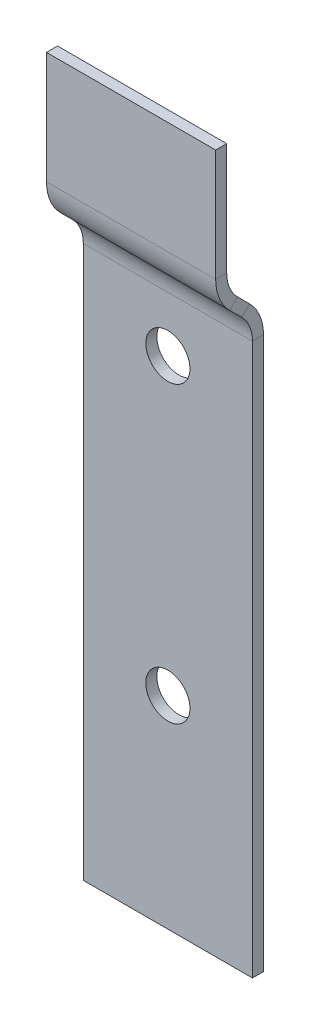
ISO-10303-21;
HEADER;
FILE_DESCRIPTION(('STEP AP214'),'2;1');
FILE_NAME('part.step','',(''),(''),'','','');
FILE_SCHEMA(('AUTOMOTIVE_DESIGN { 1 0 10303 214 1 1 1 1 }'));
ENDSEC;
DATA;
#1=APPLICATION_CONTEXT('core data for automotive mechanical design processes');
#2=APPLICATION_PROTOCOL_DEFINITION('international standard','automotive_design',2000,#1);
#3=PRODUCT_CONTEXT('',#1,'mechanical');
#4=PRODUCT('Part','Part','',(#3));
#5=PRODUCT_RELATED_PRODUCT_CATEGORY('part','',(#4));
#6=PRODUCT_DEFINITION_FORMATION('','',#4);
#7=PRODUCT_DEFINITION_CONTEXT('part definition',#1,'design');
#8=PRODUCT_DEFINITION('design','',#6,#7);
#9=PRODUCT_DEFINITION_SHAPE('','',#8);
#10=(LENGTH_UNIT() NAMED_UNIT(*) SI_UNIT(.MILLI.,.METRE.));
#11=(NAMED_UNIT(*) PLANE_ANGLE_UNIT() SI_UNIT($,.RADIAN.));
#12=(NAMED_UNIT(*) SI_UNIT($,.STERADIAN.) SOLID_ANGLE_UNIT());
#13=UNCERTAINTY_MEASURE_WITH_UNIT(LENGTH_MEASURE(1.E-05),#10,'distance_accuracy_value','');
#14=(GEOMETRIC_REPRESENTATION_CONTEXT(3) GLOBAL_UNCERTAINTY_ASSIGNED_CONTEXT((#13)) GLOBAL_UNIT_ASSIGNED_CONTEXT((#10,
#11,#12)) REPRESENTATION_CONTEXT('',''));
#15=CARTESIAN_POINT('',(0.,0.,0.));
#16=DIRECTION('',(0.,0.,1.));
#17=DIRECTION('',(1.,0.,0.));
#18=AXIS2_PLACEMENT_3D('',#15,#16,#17);
#19=CARTESIAN_POINT('',(-11.5000000000006,50.0000000000007,-50.1779765508196));
#20=DIRECTION('',(0.,1.,0.));
#21=DIRECTION('',(-1.,0.,0.));
#22=AXIS2_PLACEMENT_3D('',#19,#20,#21);
#23=PLANE('',#22);
#24=DIRECTION('',(-1.,0.,0.));
#25=VECTOR('',#24,1.);
#26=CARTESIAN_POINT('',(-11.5000000000001,50.0000000000007,4.99999999999998));
#27=LINE('',#26,#25);
#28=CARTESIAN_POINT('',(11.4999999999999,50.0000000000005,4.99999999999973));
#29=VERTEX_POINT('',#28);
#30=CARTESIAN_POINT('',(-11.5,50.0000000000007,5.00000000000018));
#31=VERTEX_POINT('',#30);
#32=EDGE_CURVE('E186',#29,#31,#27,.T.);
#33=ORIENTED_EDGE('',*,*,#32,.F.);
#34=DIRECTION('',(0.,0.,1.));
#35=VECTOR('',#34,1.);
#36=CARTESIAN_POINT('',(11.4999999999994,50.0000000000007,-50.1779765508199));
#37=LINE('',#36,#35);
#38=CARTESIAN_POINT('',(11.5,50.0000000000007,3.49999999999983));
#39=VERTEX_POINT('',#38);
#40=EDGE_CURVE('E11',#39,#29,#37,.T.);
#41=ORIENTED_EDGE('',*,*,#40,.F.);
#42=DIRECTION('',(-1.,0.,0.));
#43=VECTOR('',#42,1.);
#44=CARTESIAN_POINT('',(-11.5,50.0000000000007,3.49999999999997));
#45=LINE('',#44,#43);
#46=CARTESIAN_POINT('',(-11.5,50.0000000000007,3.49999999999997));
#47=VERTEX_POINT('',#46);
#48=EDGE_CURVE('E60',#39,#47,#45,.T.);
#49=ORIENTED_EDGE('',*,*,#48,.T.);
#50=DIRECTION('',(0.,0.,1.));
#51=VECTOR('',#50,1.);
#52=CARTESIAN_POINT('',(-11.5000000000006,50.0000000000007,-50.1779765508196));
#53=LINE('',#52,#51);
#54=EDGE_CURVE('E200',#47,#31,#53,.T.);
#55=ORIENTED_EDGE('',*,*,#54,.T.);
#56=EDGE_LOOP('',(#33,#41,#49,#55));
#57=FACE_BOUND('',#56,.T.);
#58=ADVANCED_FACE('F41',(#57),#23,.T.);
#59=CARTESIAN_POINT('',(-11.5000000000005,-51.5762347563546,-50.1779765508194));
#60=DIRECTION('',(-1.,0.,0.));
#61=DIRECTION('',(0.,-1.,0.));
#62=AXIS2_PLACEMENT_3D('',#59,#60,#61);
#63=PLANE('',#62);
#64=DIRECTION('',(0.,-1.,0.));
#65=VECTOR('',#64,1.);
#66=CARTESIAN_POINT('',(-11.4999999999997,-51.5762347563544,4.99999999999996));
#67=LINE('',#66,#65);
#68=CARTESIAN_POINT('',(-11.4999999999999,34.7634559672912,5.00000000000008));
#69=VERTEX_POINT('',#68);
#70=EDGE_CURVE('E81',#31,#69,#67,.T.);
#71=ORIENTED_EDGE('',*,*,#70,.F.);
#72=ORIENTED_EDGE('',*,*,#54,.F.);
#73=DIRECTION('',(0.,-1.,0.));
#74=VECTOR('',#73,1.);
#75=CARTESIAN_POINT('',(-11.4999999999999,-51.5762347563546,3.50000000000023));
#76=LINE('',#75,#74);
#77=CARTESIAN_POINT('',(-11.5,34.7634559672912,3.49999999999999));
#78=VERTEX_POINT('',#77);
#79=EDGE_CURVE('E197',#47,#78,#76,.T.);
#80=ORIENTED_EDGE('',*,*,#79,.T.);
#81=DIRECTION('',(0.,0.,1.));
#82=VECTOR('',#81,1.);
#83=CARTESIAN_POINT('',(-11.5000000000006,34.7634559672914,-50.1779765508196));
#84=LINE('',#83,#82);
#85=EDGE_CURVE('E195',#78,#69,#84,.T.);
#86=ORIENTED_EDGE('',*,*,#85,.T.);
#87=EDGE_LOOP('',(#71,#72,#80,#86));
#88=FACE_BOUND('',#87,.T.);
#89=ADVANCED_FACE('F214',(#88),#63,.T.);
#90=CARTESIAN_POINT('',(0.,-1.5762347563548,5.00000000000005));
#91=DIRECTION('',(0.,0.,-1.));
#92=DIRECTION('',(-1.,0.,0.));
#93=AXIS2_PLACEMENT_3D('',#90,#91,#92);
#94=PLANE('',#93);
#95=ORIENTED_EDGE('',*,*,#70,.T.);
#96=DIRECTION('',(1.,0.,0.));
#97=VECTOR('',#96,1.);
#98=CARTESIAN_POINT('',(0.,34.7634559672912,4.9999999999998));
#99=LINE('',#98,#97);
#100=CARTESIAN_POINT('',(11.5,34.7634559672911,4.99999999999985));
#101=VERTEX_POINT('',#100);
#102=EDGE_CURVE('E192',#69,#101,#99,.T.);
#103=ORIENTED_EDGE('',*,*,#102,.T.);
#104=DIRECTION('',(0.,1.,0.));
#105=VECTOR('',#104,1.);
#106=CARTESIAN_POINT('',(11.5000000000002,-51.5762347563548,4.99999999999983));
#107=LINE('',#106,#105);
#108=EDGE_CURVE('E189',#101,#29,#107,.T.);
#109=ORIENTED_EDGE('',*,*,#108,.T.);
#110=ORIENTED_EDGE('',*,*,#32,.T.);
#111=EDGE_LOOP('',(#95,#103,#109,#110));
#112=FACE_BOUND('',#111,.T.);
#113=ADVANCED_FACE('F213',(#112),#94,.F.);
#114=CARTESIAN_POINT('',(11.4999999999997,-51.5762347563547,-50.1779765508197));
#115=DIRECTION('',(1.,0.,0.));
#116=DIRECTION('',(0.,1.,0.));
#117=AXIS2_PLACEMENT_3D('',#114,#115,#116);
#118=PLANE('',#117);
#119=ORIENTED_EDGE('',*,*,#108,.F.);
#120=DIRECTION('',(0.,0.,1.));
#121=VECTOR('',#120,1.);
#122=CARTESIAN_POINT('',(11.4999999999993,34.7634559672911,-50.1779765508198));
#123=LINE('',#122,#121);
#124=CARTESIAN_POINT('',(11.5,34.7634559672911,3.49999999999975));
#125=VERTEX_POINT('',#124);
#126=EDGE_CURVE('E160',#125,#101,#123,.T.);
#127=ORIENTED_EDGE('',*,*,#126,.F.);
#128=DIRECTION('',(0.,1.,0.));
#129=VECTOR('',#128,1.);
#130=CARTESIAN_POINT('',(11.5000000000003,-51.5762347563547,3.49999999999988));
#131=LINE('',#130,#129);
#132=EDGE_CURVE('E51',#125,#39,#131,.T.);
#133=ORIENTED_EDGE('',*,*,#132,.T.);
#134=ORIENTED_EDGE('',*,*,#40,.T.);
#135=EDGE_LOOP('',(#119,#127,#133,#134));
#136=FACE_BOUND('',#135,.T.);
#137=ADVANCED_FACE('F210',(#136),#118,.T.);
#138=CARTESIAN_POINT('',(0.,-1.57623475635469,3.49999999999996));
#139=DIRECTION('',(0.,0.,-1.));
#140=DIRECTION('',(-1.,0.,0.));
#141=AXIS2_PLACEMENT_3D('',#138,#139,#140);
#142=PLANE('',#141);
#143=DIRECTION('',(1.,0.,0.));
#144=VECTOR('',#143,1.);
#145=CARTESIAN_POINT('',(-1.02340721926679E-13,34.7634559672912,3.49999999999982));
#146=LINE('',#145,#144);
#147=EDGE_CURVE('E45',#78,#125,#146,.T.);
#148=ORIENTED_EDGE('',*,*,#147,.F.);
#149=ORIENTED_EDGE('',*,*,#79,.F.);
#150=ORIENTED_EDGE('',*,*,#48,.F.);
#151=ORIENTED_EDGE('',*,*,#132,.F.);
#152=EDGE_LOOP('',(#148,#149,#150,#151));
#153=FACE_BOUND('',#152,.T.);
#154=ADVANCED_FACE('F43',(#153),#142,.T.);
#155=CARTESIAN_POINT('',(-11.5000000000001,-60.3810116129127,-22.0716497886724));
#156=DIRECTION('',(1.,0.,0.));
#157=DIRECTION('',(0.,0.707106781186548,-0.707106781186547));
#158=AXIS2_PLACEMENT_3D('',#155,#156,#157);
#159=PLANE('',#158);
#160=DIRECTION('',(0.,-0.707106781186547,-0.707106781186549));
#161=VECTOR('',#160,1.);
#162=CARTESIAN_POINT('',(-11.5000000000001,-26.6301366230799,-55.8225247785052));
#163=LINE('',#162,#161);
#164=CARTESIAN_POINT('',(-11.5000000000001,31.227922061358,2.03553390593287));
#165=VERTEX_POINT('',#164);
#166=CARTESIAN_POINT('',(-11.5000000000001,29.5961940777128,0.403805922287274));
#167=VERTEX_POINT('',#166);
#168=EDGE_CURVE('E234',#165,#167,#163,.T.);
#169=ORIENTED_EDGE('',*,*,#168,.T.);
#170=DIRECTION('',(0.,0.707106781186548,-0.707106781186547));
#171=VECTOR('',#170,1.);
#172=CARTESIAN_POINT('',(-11.5000000000001,-4.15468091212007,34.1546809121201));
#173=LINE('',#172,#171);
#174=CARTESIAN_POINT('',(-11.5000000000001,28.5355339059329,1.46446609406716));
#175=VERTEX_POINT('',#174);
#176=EDGE_CURVE('E179',#175,#167,#173,.T.);
#177=ORIENTED_EDGE('',*,*,#176,.F.);
#178=DIRECTION('',(0.,-0.707106781186547,-0.707106781186549));
#179=VECTOR('',#178,1.);
#180=CARTESIAN_POINT('',(-11.5000000000001,-27.6907967948597,-54.7618646067254));
#181=LINE('',#180,#179);
#182=CARTESIAN_POINT('',(-11.5000000000001,30.1672618895784,3.09619407771242));
#183=VERTEX_POINT('',#182);
#184=EDGE_CURVE('E151',#183,#175,#181,.T.);
#185=ORIENTED_EDGE('',*,*,#184,.F.);
#186=DIRECTION('',(0.,0.707106781186548,-0.707106781186547));
#187=VECTOR('',#186,1.);
#188=CARTESIAN_POINT('',(-11.5000000000001,-2.52295292847457,35.7864088957653));
#189=LINE('',#188,#187);
#190=EDGE_CURVE('E182',#183,#165,#189,.T.);
#191=ORIENTED_EDGE('',*,*,#190,.T.);
#192=EDGE_LOOP('',(#169,#177,#185,#191));
#193=FACE_BOUND('',#192,.T.);
#194=ADVANCED_FACE('F283',(#193),#159,.F.);
#195=CARTESIAN_POINT('',(11.5,-60.3810116129124,-22.0716497886727));
#196=DIRECTION('',(-1.,0.,0.));
#197=DIRECTION('',(0.,-0.707106781186548,0.707106781186547));
#198=AXIS2_PLACEMENT_3D('',#195,#196,#197);
#199=PLANE('',#198);
#200=DIRECTION('',(0.,0.707106781186547,0.707106781186549));
#201=VECTOR('',#200,1.);
#202=CARTESIAN_POINT('',(11.5,-26.6301366230796,-55.8225247785055));
#203=LINE('',#202,#201);
#204=CARTESIAN_POINT('',(11.4999999999998,29.596194077713,0.403805922287229));
#205=VERTEX_POINT('',#204);
#206=CARTESIAN_POINT('',(11.4999999999999,31.2279220613584,2.03553390593253));
#207=VERTEX_POINT('',#206);
#208=EDGE_CURVE('E169',#205,#207,#203,.T.);
#209=ORIENTED_EDGE('',*,*,#208,.T.);
#210=DIRECTION('',(0.,0.707106781186548,-0.707106781186547));
#211=VECTOR('',#210,1.);
#212=CARTESIAN_POINT('',(11.4999999999998,-2.52295292847445,35.7864088957653));
#213=LINE('',#212,#211);
#214=CARTESIAN_POINT('',(11.4999999999999,30.1672618895785,3.09619407771243));
#215=VERTEX_POINT('',#214);
#216=EDGE_CURVE('E157',#215,#207,#213,.T.);
#217=ORIENTED_EDGE('',*,*,#216,.F.);
#218=DIRECTION('',(0.,0.707106781186547,0.707106781186549));
#219=VECTOR('',#218,1.);
#220=CARTESIAN_POINT('',(11.5,-27.6907967948594,-54.7618646067256));
#221=LINE('',#220,#219);
#222=CARTESIAN_POINT('',(11.4999999999999,28.5355339059329,1.4644660940673));
#223=VERTEX_POINT('',#222);
#224=EDGE_CURVE('E167',#223,#215,#221,.T.);
#225=ORIENTED_EDGE('',*,*,#224,.F.);
#226=DIRECTION('',(0.,0.707106781186548,-0.707106781186547));
#227=VECTOR('',#226,1.);
#228=CARTESIAN_POINT('',(11.4999999999999,-4.15468091211991,34.15468091212));
#229=LINE('',#228,#227);
#230=EDGE_CURVE('E171',#223,#205,#229,.T.);
#231=ORIENTED_EDGE('',*,*,#230,.T.);
#232=EDGE_LOOP('',(#209,#217,#225,#231));
#233=FACE_BOUND('',#232,.T.);
#234=ADVANCED_FACE('F165',(#233),#199,.F.);
#235=CARTESIAN_POINT('',(0.,7.6645422644677,-19.406525547398));
#236=DIRECTION('',(0.,0.707106781186549,-0.707106781186547));
#237=DIRECTION('',(-1.,0.,0.));
#238=AXIS2_PLACEMENT_3D('',#235,#236,#237);
#239=PLANE('',#238);
#240=DIRECTION('',(1.,0.,0.));
#241=VECTOR('',#240,1.);
#242=CARTESIAN_POINT('',(-1.34958498477987E-13,30.1672618895784,3.09619407771242));
#243=LINE('',#242,#241);
#244=EDGE_CURVE('E147',#183,#215,#243,.T.);
#245=ORIENTED_EDGE('',*,*,#244,.F.);
#246=ORIENTED_EDGE('',*,*,#184,.T.);
#247=DIRECTION('',(1.,0.,0.));
#248=VECTOR('',#247,1.);
#249=CARTESIAN_POINT('',(-1.50122922943837E-13,28.5355339059328,1.46446609406721));
#250=LINE('',#249,#248);
#251=EDGE_CURVE('E97',#175,#223,#250,.T.);
#252=ORIENTED_EDGE('',*,*,#251,.T.);
#253=ORIENTED_EDGE('',*,*,#224,.T.);
#254=EDGE_LOOP('',(#245,#246,#252,#253));
#255=FACE_BOUND('',#254,.T.);
#256=ADVANCED_FACE('F173',(#255),#239,.F.);
#257=CARTESIAN_POINT('',(0.,8.7252024362475,-20.4671857191777));
#258=DIRECTION('',(0.,0.707106781186549,-0.707106781186547));
#259=DIRECTION('',(-1.,0.,0.));
#260=AXIS2_PLACEMENT_3D('',#257,#258,#259);
#261=PLANE('',#260);
#262=ORIENTED_EDGE('',*,*,#168,.F.);
#263=DIRECTION('',(1.,0.,0.));
#264=VECTOR('',#263,1.);
#265=CARTESIAN_POINT('',(-1.50504209552341E-13,31.2279220613582,2.03553390593255));
#266=LINE('',#265,#264);
#267=EDGE_CURVE('E277',#165,#207,#266,.T.);
#268=ORIENTED_EDGE('',*,*,#267,.T.);
#269=ORIENTED_EDGE('',*,*,#208,.F.);
#270=DIRECTION('',(1.,0.,0.));
#271=VECTOR('',#270,1.);
#272=CARTESIAN_POINT('',(0.,29.5961940777126,0.403805922287306));
#273=LINE('',#272,#271);
#274=EDGE_CURVE('E152',#167,#205,#273,.T.);
#275=ORIENTED_EDGE('',*,*,#274,.F.);
#276=EDGE_LOOP('',(#262,#268,#269,#275));
#277=FACE_BOUND('',#276,.T.);
#278=ADVANCED_FACE('F318',(#277),#261,.T.);
#279=CARTESIAN_POINT('',(-11.4999999999999,-49.9999999999997,156.894869259642));
#280=DIRECTION('',(0.,1.,0.));
#281=DIRECTION('',(-1.,0.,0.));
#282=AXIS2_PLACEMENT_3D('',#279,#280,#281);
#283=PLANE('',#282);
#284=DIRECTION('',(1.,0.,0.));
#285=VECTOR('',#284,1.);
#286=CARTESIAN_POINT('',(-11.4999999999999,-50.,-1.49999999999987));
#287=LINE('',#286,#285);
#288=CARTESIAN_POINT('',(-11.4999999999999,-49.9999999999997,-1.50000000000008));
#289=VERTEX_POINT('',#288);
#290=CARTESIAN_POINT('',(11.5,-50.,-1.5));
#291=VERTEX_POINT('',#290);
#292=EDGE_CURVE('E268',#289,#291,#287,.T.);
#293=ORIENTED_EDGE('',*,*,#292,.T.);
#294=DIRECTION('',(0.,0.,-1.));
#295=VECTOR('',#294,1.);
#296=CARTESIAN_POINT('',(11.5,-49.9999999999999,156.894869259642));
#297=LINE('',#296,#295);
#298=CARTESIAN_POINT('',(11.5,-49.9999999999999,0.));
#299=VERTEX_POINT('',#298);
#300=EDGE_CURVE('E232',#299,#291,#297,.T.);
#301=ORIENTED_EDGE('',*,*,#300,.F.);
#302=DIRECTION('',(1.,0.,0.));
#303=VECTOR('',#302,1.);
#304=CARTESIAN_POINT('',(-11.4999999999999,-49.9999999999997,-1.14925430283463E-13));
#305=LINE('',#304,#303);
#306=CARTESIAN_POINT('',(-11.4999999999999,-49.9999999999997,-1.14925430283463E-13));
#307=VERTEX_POINT('',#306);
#308=EDGE_CURVE('E255',#307,#299,#305,.T.);
#309=ORIENTED_EDGE('',*,*,#308,.F.);
#310=DIRECTION('',(0.,0.,-1.));
#311=VECTOR('',#310,1.);
#312=CARTESIAN_POINT('',(-11.4999999999999,-49.9999999999997,156.894869259642));
#313=LINE('',#312,#311);
#314=EDGE_CURVE('E265',#307,#289,#313,.T.);
#315=ORIENTED_EDGE('',*,*,#314,.T.);
#316=EDGE_LOOP('',(#293,#301,#309,#315));
#317=FACE_BOUND('',#316,.T.);
#318=ADVANCED_FACE('F304',(#317),#283,.F.);
#319=CARTESIAN_POINT('',(-1.33573707650214E-13,-22.5000000000001,-1.50100000000003));
#320=DIRECTION('',(0.,0.,1.));
#321=DIRECTION('',(1.,0.,0.));
#322=AXIS2_PLACEMENT_3D('',#319,#320,#321);
#323=CYLINDRICAL_SURFACE('',#322,3.);
#324=CARTESIAN_POINT('',(-1.33573707650214E-13,-22.4999999999999,-1.5000000000001));
#325=DIRECTION('',(0.,0.,-1.));
#326=DIRECTION('',(-1.,0.,0.));
#327=AXIS2_PLACEMENT_3D('',#324,#325,#326);
#328=CIRCLE('',#327,3.);
#329=CARTESIAN_POINT('',(-3.00000000000013,-22.4999999999999,-1.5000000000001));
#330=VERTEX_POINT('',#329);
#331=EDGE_CURVE('E241',#330,#330,#328,.F.);
#332=ORIENTED_EDGE('',*,*,#331,.F.);
#333=EDGE_LOOP('',(#332));
#334=FACE_BOUND('',#333,.T.);
#335=CARTESIAN_POINT('',(-1.2490009027033E-13,-22.5,0.));
#336=DIRECTION('',(0.,0.,1.));
#337=DIRECTION('',(1.,0.,0.));
#338=AXIS2_PLACEMENT_3D('',#335,#336,#337);
#339=CIRCLE('',#338,3.);
#340=CARTESIAN_POINT('',(2.99999999999988,-22.5,0.));
#341=VERTEX_POINT('',#340);
#342=EDGE_CURVE('E262',#341,#341,#339,.T.);
#343=ORIENTED_EDGE('',*,*,#342,.T.);
#344=EDGE_LOOP('',(#343));
#345=FACE_BOUND('',#344,.T.);
#346=ADVANCED_FACE('F326',(#334,#345),#323,.F.);
#347=CARTESIAN_POINT('',(0.,17.5000000000002,-1.50100000000018));
#348=DIRECTION('',(0.,0.,1.));
#349=DIRECTION('',(1.,0.,0.));
#350=AXIS2_PLACEMENT_3D('',#347,#348,#349);
#351=CYLINDRICAL_SURFACE('',#350,3.);
#352=CARTESIAN_POINT('',(0.,17.5000000000001,-1.50000000000006));
#353=DIRECTION('',(0.,0.,-1.));
#354=DIRECTION('',(-1.,0.,0.));
#355=AXIS2_PLACEMENT_3D('',#352,#353,#354);
#356=CIRCLE('',#355,3.);
#357=CARTESIAN_POINT('',(-2.99999999999995,17.5000000000001,-1.50000000000006));
#358=VERTEX_POINT('',#357);
#359=EDGE_CURVE('E244',#358,#358,#356,.F.);
#360=ORIENTED_EDGE('',*,*,#359,.F.);
#361=EDGE_LOOP('',(#360));
#362=FACE_BOUND('',#361,.T.);
#363=CARTESIAN_POINT('',(-1.45716771982052E-13,17.5000000000001,0.));
#364=DIRECTION('',(0.,0.,1.));
#365=DIRECTION('',(1.,0.,0.));
#366=AXIS2_PLACEMENT_3D('',#363,#364,#365);
#367=CIRCLE('',#366,3.);
#368=CARTESIAN_POINT('',(2.99999999999985,17.5000000000001,0.));
#369=VERTEX_POINT('',#368);
#370=EDGE_CURVE('E259',#369,#369,#367,.T.);
#371=ORIENTED_EDGE('',*,*,#370,.T.);
#372=EDGE_LOOP('',(#371));
#373=FACE_BOUND('',#372,.T.);
#374=ADVANCED_FACE('F489',(#362,#373),#351,.F.);
#375=CARTESIAN_POINT('',(0.,0.,0.));
#376=DIRECTION('',(0.,0.,-1.));
#377=DIRECTION('',(-1.,0.,0.));
#378=AXIS2_PLACEMENT_3D('',#375,#376,#377);
#379=PLANE('',#378);
#380=ORIENTED_EDGE('',*,*,#370,.F.);
#381=EDGE_LOOP('',(#380));
#382=FACE_BOUND('',#381,.T.);
#383=ORIENTED_EDGE('',*,*,#342,.F.);
#384=EDGE_LOOP('',(#383));
#385=FACE_BOUND('',#384,.T.);
#386=DIRECTION('',(1.,0.,0.));
#387=VECTOR('',#386,1.);
#388=CARTESIAN_POINT('',(0.,25.,0.));
#389=LINE('',#388,#387);
#390=CARTESIAN_POINT('',(-11.5,25.0000000000002,-1.04950770296597E-13));
#391=VERTEX_POINT('',#390);
#392=CARTESIAN_POINT('',(11.4999999999999,25.0000000000004,-1.50920942409982E-13));
#393=VERTEX_POINT('',#392);
#394=EDGE_CURVE('E228',#391,#393,#389,.T.);
#395=ORIENTED_EDGE('',*,*,#394,.F.);
#396=DIRECTION('',(0.,-1.,0.));
#397=VECTOR('',#396,1.);
#398=CARTESIAN_POINT('',(-11.4999999999999,-49.9999999999997,-1.14925430283463E-13));
#399=LINE('',#398,#397);
#400=EDGE_CURVE('E257',#391,#307,#399,.T.);
#401=ORIENTED_EDGE('',*,*,#400,.T.);
#402=ORIENTED_EDGE('',*,*,#308,.T.);
#403=DIRECTION('',(0.,1.,0.));
#404=VECTOR('',#403,1.);
#405=CARTESIAN_POINT('',(11.5,-49.9999999999999,-1.83663848019044E-13));
#406=LINE('',#405,#404);
#407=EDGE_CURVE('E252',#299,#393,#406,.T.);
#408=ORIENTED_EDGE('',*,*,#407,.T.);
#409=EDGE_LOOP('',(#395,#401,#402,#408));
#410=FACE_BOUND('',#409,.T.);
#411=ADVANCED_FACE('F308',(#382,#385,#410),#379,.F.);
#412=CARTESIAN_POINT('',(-11.4999999999999,-49.9999999999997,156.894869259642));
#413=DIRECTION('',(1.,0.,0.));
#414=DIRECTION('',(0.,1.,0.));
#415=AXIS2_PLACEMENT_3D('',#412,#413,#414);
#416=PLANE('',#415);
#417=DIRECTION('',(0.,-1.,0.));
#418=VECTOR('',#417,1.);
#419=CARTESIAN_POINT('',(-11.4999999999999,-50.,-1.49999999999987));
#420=LINE('',#419,#418);
#421=CARTESIAN_POINT('',(-11.4999999999999,25.0000000000002,-1.50000000000008));
#422=VERTEX_POINT('',#421);
#423=EDGE_CURVE('E250',#422,#289,#420,.T.);
#424=ORIENTED_EDGE('',*,*,#423,.T.);
#425=ORIENTED_EDGE('',*,*,#314,.F.);
#426=ORIENTED_EDGE('',*,*,#400,.F.);
#427=DIRECTION('',(0.,0.,-1.));
#428=VECTOR('',#427,1.);
#429=CARTESIAN_POINT('',(-11.4999999999999,25.0000000000002,156.894869259642));
#430=LINE('',#429,#428);
#431=EDGE_CURVE('E247',#391,#422,#430,.T.);
#432=ORIENTED_EDGE('',*,*,#431,.T.);
#433=EDGE_LOOP('',(#424,#425,#426,#432));
#434=FACE_BOUND('',#433,.T.);
#435=ADVANCED_FACE('F296',(#434),#416,.F.);
#436=CARTESIAN_POINT('',(-1.38777878078145E-13,1.66533453693773E-13,-1.50000000000009));
#437=DIRECTION('',(0.,0.,-1.));
#438=DIRECTION('',(-1.,0.,0.));
#439=AXIS2_PLACEMENT_3D('',#436,#437,#438);
#440=PLANE('',#439);
#441=ORIENTED_EDGE('',*,*,#359,.T.);
#442=EDGE_LOOP('',(#441));
#443=FACE_BOUND('',#442,.T.);
#444=ORIENTED_EDGE('',*,*,#331,.T.);
#445=EDGE_LOOP('',(#444));
#446=FACE_BOUND('',#445,.T.);
#447=ORIENTED_EDGE('',*,*,#423,.F.);
#448=DIRECTION('',(1.,0.,0.));
#449=VECTOR('',#448,1.);
#450=CARTESIAN_POINT('',(0.,25.0000000000001,-1.50000000000012));
#451=LINE('',#450,#449);
#452=CARTESIAN_POINT('',(11.4999999999999,25.0000000000004,-1.50000000000024));
#453=VERTEX_POINT('',#452);
#454=EDGE_CURVE('E238',#422,#453,#451,.T.);
#455=ORIENTED_EDGE('',*,*,#454,.T.);
#456=DIRECTION('',(0.,1.,0.));
#457=VECTOR('',#456,1.);
#458=CARTESIAN_POINT('',(11.5,-50.,-1.5));
#459=LINE('',#458,#457);
#460=EDGE_CURVE('E235',#291,#453,#459,.T.);
#461=ORIENTED_EDGE('',*,*,#460,.F.);
#462=ORIENTED_EDGE('',*,*,#292,.F.);
#463=EDGE_LOOP('',(#447,#455,#461,#462));
#464=FACE_BOUND('',#463,.T.);
#465=ADVANCED_FACE('F300',(#443,#446,#464),#440,.T.);
#466=CARTESIAN_POINT('',(11.5,-49.9999999999999,156.894869259642));
#467=DIRECTION('',(-1.,0.,0.));
#468=DIRECTION('',(0.,-1.,0.));
#469=AXIS2_PLACEMENT_3D('',#466,#467,#468);
#470=PLANE('',#469);
#471=ORIENTED_EDGE('',*,*,#460,.T.);
#472=DIRECTION('',(0.,0.,-1.));
#473=VECTOR('',#472,1.);
#474=CARTESIAN_POINT('',(11.5,25.0000000000004,156.894869259642));
#475=LINE('',#474,#473);
#476=EDGE_CURVE('E271',#393,#453,#475,.T.);
#477=ORIENTED_EDGE('',*,*,#476,.F.);
#478=ORIENTED_EDGE('',*,*,#407,.F.);
#479=ORIENTED_EDGE('',*,*,#300,.T.);
#480=EDGE_LOOP('',(#471,#477,#478,#479));
#481=FACE_BOUND('',#480,.T.);
#482=ADVANCED_FACE('F311',(#481),#470,.F.);
#483=CARTESIAN_POINT('',(11.4999999999999,25.0000000000004,4.99999999999985));
#484=DIRECTION('',(1.,0.,0.));
#485=DIRECTION('',(0.,1.,0.));
#486=AXIS2_PLACEMENT_3D('',#483,#484,#485);
#487=PLANE('',#486);
#488=ORIENTED_EDGE('',*,*,#230,.F.);
#489=CARTESIAN_POINT('',(11.4999999999998,25.0000000000004,4.99999999999985));
#490=DIRECTION('',(-1.,0.,0.));
#491=DIRECTION('',(0.,-1.,0.));
#492=AXIS2_PLACEMENT_3D('',#489,#490,#491);
#493=CIRCLE('',#492,5.);
#494=EDGE_CURVE('E216',#223,#393,#493,.T.);
#495=ORIENTED_EDGE('',*,*,#494,.T.);
#496=ORIENTED_EDGE('',*,*,#476,.T.);
#497=CARTESIAN_POINT('',(11.4999999999998,25.0000000000004,4.99999999999985));
#498=DIRECTION('',(-1.,0.,0.));
#499=DIRECTION('',(0.,-1.,0.));
#500=AXIS2_PLACEMENT_3D('',#497,#498,#499);
#501=CIRCLE('',#500,6.50000000000009);
#502=EDGE_CURVE('E223',#205,#453,#501,.T.);
#503=ORIENTED_EDGE('',*,*,#502,.F.);
#504=EDGE_LOOP('',(#488,#495,#496,#503));
#505=FACE_BOUND('',#504,.T.);
#506=ADVANCED_FACE('F314',(#505),#487,.T.);
#507=CARTESIAN_POINT('',(-11.4999999999999,25.0000000000002,4.9999999999999));
#508=DIRECTION('',(-1.,0.,0.));
#509=DIRECTION('',(0.,-1.,0.));
#510=AXIS2_PLACEMENT_3D('',#507,#508,#509);
#511=PLANE('',#510);
#512=CARTESIAN_POINT('',(-11.4999999999999,25.0000000000002,4.9999999999999));
#513=DIRECTION('',(-1.,0.,0.));
#514=DIRECTION('',(0.,-1.,0.));
#515=AXIS2_PLACEMENT_3D('',#512,#513,#514);
#516=CIRCLE('',#515,5.);
#517=EDGE_CURVE('E218',#391,#175,#516,.F.);
#518=ORIENTED_EDGE('',*,*,#517,.T.);
#519=ORIENTED_EDGE('',*,*,#176,.T.);
#520=CARTESIAN_POINT('',(-11.4999999999999,25.0000000000002,4.9999999999999));
#521=DIRECTION('',(-1.,0.,0.));
#522=DIRECTION('',(0.,-1.,0.));
#523=AXIS2_PLACEMENT_3D('',#520,#521,#522);
#524=CIRCLE('',#523,6.50000000000009);
#525=EDGE_CURVE('E226',#422,#167,#524,.F.);
#526=ORIENTED_EDGE('',*,*,#525,.F.);
#527=ORIENTED_EDGE('',*,*,#431,.F.);
#528=EDGE_LOOP('',(#518,#519,#526,#527));
#529=FACE_BOUND('',#528,.T.);
#530=ADVANCED_FACE('F292',(#529),#511,.T.);
#531=CARTESIAN_POINT('',(115.658444051734,25.0000000000011,4.99999999999964));
#532=DIRECTION('',(-1.,0.,0.));
#533=DIRECTION('',(0.,-1.,0.));
#534=AXIS2_PLACEMENT_3D('',#531,#532,#533);
#535=CYLINDRICAL_SURFACE('',#534,6.50000000000009);
#536=ORIENTED_EDGE('',*,*,#454,.F.);
#537=ORIENTED_EDGE('',*,*,#525,.T.);
#538=ORIENTED_EDGE('',*,*,#274,.T.);
#539=ORIENTED_EDGE('',*,*,#502,.T.);
#540=EDGE_LOOP('',(#536,#537,#538,#539));
#541=FACE_BOUND('',#540,.T.);
#542=ADVANCED_FACE('F316',(#541),#535,.T.);
#543=CARTESIAN_POINT('',(115.658444051734,25.0000000000011,4.99999999999964));
#544=DIRECTION('',(-1.,0.,0.));
#545=DIRECTION('',(0.,-1.,0.));
#546=AXIS2_PLACEMENT_3D('',#543,#544,#545);
#547=CYLINDRICAL_SURFACE('',#546,5.);
#548=ORIENTED_EDGE('',*,*,#394,.T.);
#549=ORIENTED_EDGE('',*,*,#494,.F.);
#550=ORIENTED_EDGE('',*,*,#251,.F.);
#551=ORIENTED_EDGE('',*,*,#517,.F.);
#552=EDGE_LOOP('',(#548,#549,#550,#551));
#553=FACE_BOUND('',#552,.T.);
#554=ADVANCED_FACE('F290',(#553),#547,.F.);
#555=CARTESIAN_POINT('',(11.4999999999999,34.7634559672911,-1.50000000000025));
#556=DIRECTION('',(-1.,0.,0.));
#557=DIRECTION('',(0.,0.,1.));
#558=AXIS2_PLACEMENT_3D('',#555,#556,#557);
#559=PLANE('',#558);
#560=ORIENTED_EDGE('',*,*,#216,.T.);
#561=CARTESIAN_POINT('',(11.5,34.7634559672911,-1.50000000000025));
#562=DIRECTION('',(1.,0.,0.));
#563=DIRECTION('',(0.,0.,-1.));
#564=AXIS2_PLACEMENT_3D('',#561,#562,#563);
#565=CIRCLE('',#564,5.);
#566=EDGE_CURVE('E206',#125,#207,#565,.T.);
#567=ORIENTED_EDGE('',*,*,#566,.F.);
#568=ORIENTED_EDGE('',*,*,#126,.T.);
#569=CARTESIAN_POINT('',(11.5,34.7634559672911,-1.50000000000025));
#570=DIRECTION('',(1.,0.,0.));
#571=DIRECTION('',(0.,0.,-1.));
#572=AXIS2_PLACEMENT_3D('',#569,#570,#571);
#573=CIRCLE('',#572,6.50000000000009);
#574=EDGE_CURVE('E74',#101,#215,#573,.T.);
#575=ORIENTED_EDGE('',*,*,#574,.T.);
#576=EDGE_LOOP('',(#560,#567,#568,#575));
#577=FACE_BOUND('',#576,.T.);
#578=ADVANCED_FACE('F156',(#577),#559,.F.);
#579=CARTESIAN_POINT('',(-11.5000000000002,34.7634559672912,-1.50000000000001));
#580=DIRECTION('',(1.,0.,0.));
#581=DIRECTION('',(0.,0.,-1.));
#582=AXIS2_PLACEMENT_3D('',#579,#580,#581);
#583=PLANE('',#582);
#584=CARTESIAN_POINT('',(-11.5000000000002,34.7634559672912,-1.50000000000001));
#585=DIRECTION('',(1.,0.,0.));
#586=DIRECTION('',(0.,0.,-1.));
#587=AXIS2_PLACEMENT_3D('',#584,#585,#586);
#588=CIRCLE('',#587,5.);
#589=EDGE_CURVE('E89',#165,#78,#588,.F.);
#590=ORIENTED_EDGE('',*,*,#589,.F.);
#591=ORIENTED_EDGE('',*,*,#190,.F.);
#592=CARTESIAN_POINT('',(-11.5000000000002,34.7634559672912,-1.50000000000001));
#593=DIRECTION('',(1.,0.,0.));
#594=DIRECTION('',(0.,0.,-1.));
#595=AXIS2_PLACEMENT_3D('',#592,#593,#594);
#596=CIRCLE('',#595,6.50000000000009);
#597=EDGE_CURVE('E149',#183,#69,#596,.F.);
#598=ORIENTED_EDGE('',*,*,#597,.T.);
#599=ORIENTED_EDGE('',*,*,#85,.F.);
#600=EDGE_LOOP('',(#590,#591,#598,#599));
#601=FACE_BOUND('',#600,.T.);
#602=ADVANCED_FACE('F215',(#601),#583,.F.);
#603=CARTESIAN_POINT('',(-111.178019717646,34.7634559672917,-1.49999999999897));
#604=DIRECTION('',(1.,0.,0.));
#605=DIRECTION('',(0.,0.,-1.));
#606=AXIS2_PLACEMENT_3D('',#603,#604,#605);
#607=CYLINDRICAL_SURFACE('',#606,6.50000000000009);
#608=ORIENTED_EDGE('',*,*,#102,.F.);
#609=ORIENTED_EDGE('',*,*,#597,.F.);
#610=ORIENTED_EDGE('',*,*,#244,.T.);
#611=ORIENTED_EDGE('',*,*,#574,.F.);
#612=EDGE_LOOP('',(#608,#609,#610,#611));
#613=FACE_BOUND('',#612,.T.);
#614=ADVANCED_FACE('F148',(#613),#607,.T.);
#615=CARTESIAN_POINT('',(-111.178019717646,34.7634559672917,-1.49999999999897));
#616=DIRECTION('',(1.,0.,0.));
#617=DIRECTION('',(0.,0.,-1.));
#618=AXIS2_PLACEMENT_3D('',#615,#616,#617);
#619=CYLINDRICAL_SURFACE('',#618,5.);
#620=ORIENTED_EDGE('',*,*,#147,.T.);
#621=ORIENTED_EDGE('',*,*,#566,.T.);
#622=ORIENTED_EDGE('',*,*,#267,.F.);
#623=ORIENTED_EDGE('',*,*,#589,.T.);
#624=EDGE_LOOP('',(#620,#621,#622,#623));
#625=FACE_BOUND('',#624,.T.);
#626=ADVANCED_FACE('F205',(#625),#619,.F.);
#627=CLOSED_SHELL('',(#58,#89,#113,#137,#154,#194,#234,#256,#278,#318,#346,#374,#411,#435,#465,
#482,#506,#530,#542,#554,#578,#602,#614,#626));
#628=MANIFOLD_SOLID_BREP('B2',#627);
#629=ADVANCED_BREP_SHAPE_REPRESENTATION('',(#18,#628),#14);
#630=SHAPE_DEFINITION_REPRESENTATION(#9,#629);
ENDSEC;
END-ISO-10303-21;
